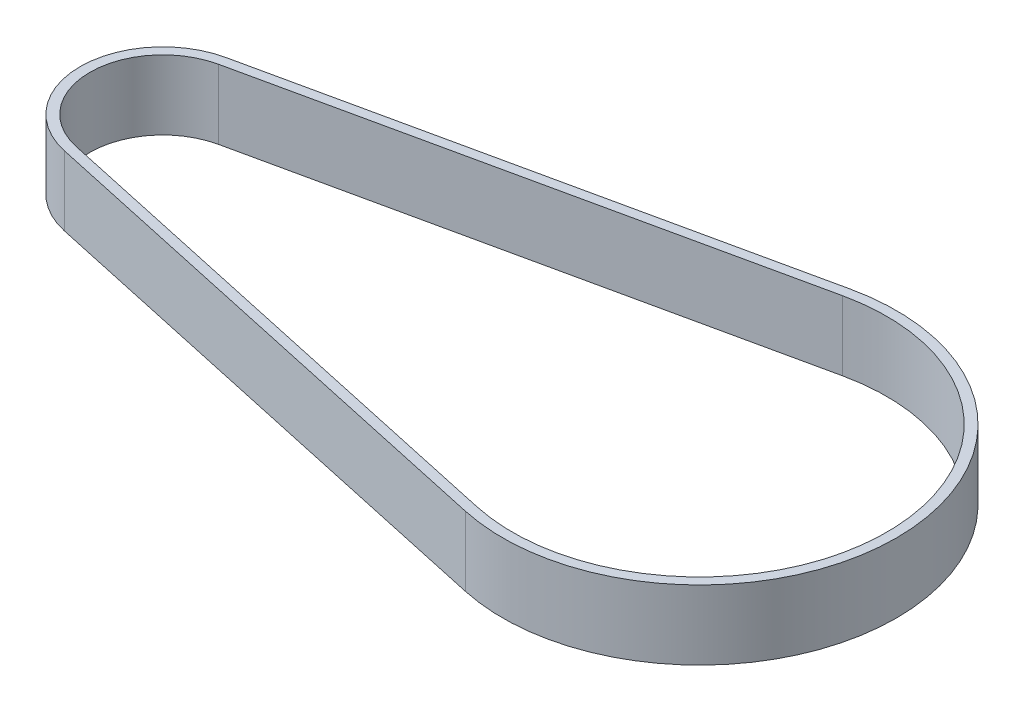
ISO-10303-21;
HEADER;
FILE_DESCRIPTION(('STEP AP214'),'2;1');
FILE_NAME('part.step','',(''),(''),'','','');
FILE_SCHEMA(('AUTOMOTIVE_DESIGN { 1 0 10303 214 1 1 1 1 }'));
ENDSEC;
DATA;
#1=APPLICATION_CONTEXT('core data for automotive mechanical design processes');
#2=APPLICATION_PROTOCOL_DEFINITION('international standard','automotive_design',2000,#1);
#3=PRODUCT_CONTEXT('',#1,'mechanical');
#4=PRODUCT('Part','Part','',(#3));
#5=PRODUCT_RELATED_PRODUCT_CATEGORY('part','',(#4));
#6=PRODUCT_DEFINITION_FORMATION('','',#4);
#7=PRODUCT_DEFINITION_CONTEXT('part definition',#1,'design');
#8=PRODUCT_DEFINITION('design','',#6,#7);
#9=PRODUCT_DEFINITION_SHAPE('','',#8);
#10=(LENGTH_UNIT() NAMED_UNIT(*) SI_UNIT(.MILLI.,.METRE.));
#11=(NAMED_UNIT(*) PLANE_ANGLE_UNIT() SI_UNIT($,.RADIAN.));
#12=(NAMED_UNIT(*) SI_UNIT($,.STERADIAN.) SOLID_ANGLE_UNIT());
#13=UNCERTAINTY_MEASURE_WITH_UNIT(LENGTH_MEASURE(1.E-05),#10,'distance_accuracy_value','');
#14=(GEOMETRIC_REPRESENTATION_CONTEXT(3) GLOBAL_UNCERTAINTY_ASSIGNED_CONTEXT((#13)) GLOBAL_UNIT_ASSIGNED_CONTEXT((#10,
#11,#12)) REPRESENTATION_CONTEXT('',''));
#15=CARTESIAN_POINT('',(0.,0.,0.));
#16=DIRECTION('',(0.,0.,1.));
#17=DIRECTION('',(1.,0.,0.));
#18=AXIS2_PLACEMENT_3D('',#15,#16,#17);
#19=CARTESIAN_POINT('',(-71.8766789781022,9.,10.473355567288));
#20=DIRECTION('',(0.212773722627737,0.,-0.977101500847857));
#21=DIRECTION('',(-0.977101500847857,0.,-0.212773722627737));
#22=AXIS2_PLACEMENT_3D('',#19,#20,#21);
#23=PLANE('',#22);
#24=DIRECTION('',(0.,-1.,0.));
#25=VECTOR('',#24,1.);
#26=CARTESIAN_POINT('',(-5.43147481751825,9.,24.9424700121432));
#27=LINE('',#26,#25);
#28=CARTESIAN_POINT('',(-5.43147481751825,9.,24.9424700121432));
#29=VERTEX_POINT('',#28);
#30=CARTESIAN_POINT('',(-5.43147481751825,0.,24.9424700121432));
#31=VERTEX_POINT('',#30);
#32=EDGE_CURVE('E91',#29,#31,#27,.T.);
#33=ORIENTED_EDGE('',*,*,#32,.F.);
#34=DIRECTION('',(0.977101500847857,0.,0.212773722627737));
#35=VECTOR('',#34,1.);
#36=CARTESIAN_POINT('',(-71.8766789781022,9.,10.473355567288));
#37=LINE('',#36,#35);
#38=CARTESIAN_POINT('',(-71.8766789781022,9.,10.473355567288));
#39=VERTEX_POINT('',#38);
#40=EDGE_CURVE('E90',#39,#29,#37,.T.);
#41=ORIENTED_EDGE('',*,*,#40,.F.);
#42=DIRECTION('',(0.,-1.,0.));
#43=VECTOR('',#42,1.);
#44=CARTESIAN_POINT('',(-71.8766789781022,9.,10.473355567288));
#45=LINE('',#44,#43);
#46=CARTESIAN_POINT('',(-71.8766789781022,0.,10.473355567288));
#47=VERTEX_POINT('',#46);
#48=EDGE_CURVE('E78',#47,#39,#45,.F.);
#49=ORIENTED_EDGE('',*,*,#48,.F.);
#50=DIRECTION('',(0.977101500847857,0.,0.212773722627737));
#51=VECTOR('',#50,1.);
#52=CARTESIAN_POINT('',(-71.8766789781022,0.,10.473355567288));
#53=LINE('',#52,#51);
#54=EDGE_CURVE('E106',#47,#31,#53,.T.);
#55=ORIENTED_EDGE('',*,*,#54,.T.);
#56=EDGE_LOOP('',(#33,#41,#49,#55));
#57=FACE_BOUND('',#56,.T.);
#58=ADVANCED_FACE('F16',(#57),#23,.F.);
#59=CARTESIAN_POINT('',(-69.596,9.,0.));
#60=DIRECTION('',(0.,-1.,0.));
#61=DIRECTION('',(0.,0.,-1.));
#62=AXIS2_PLACEMENT_3D('',#59,#60,#61);
#63=CYLINDRICAL_SURFACE('',#62,10.7188);
#64=CARTESIAN_POINT('',(-69.596,9.,0.));
#65=DIRECTION('',(0.,-1.,0.));
#66=DIRECTION('',(0.,0.,-1.));
#67=AXIS2_PLACEMENT_3D('',#64,#65,#66);
#68=CIRCLE('',#67,10.7188);
#69=CARTESIAN_POINT('',(-71.8766789781022,9.,-10.473355567288));
#70=VERTEX_POINT('',#69);
#71=EDGE_CURVE('E19',#70,#39,#68,.F.);
#72=ORIENTED_EDGE('',*,*,#71,.F.);
#73=DIRECTION('',(0.,1.,0.));
#74=VECTOR('',#73,1.);
#75=CARTESIAN_POINT('',(-71.8766789781022,9.,-10.473355567288));
#76=LINE('',#75,#74);
#77=CARTESIAN_POINT('',(-71.8766789781022,0.,-10.473355567288));
#78=VERTEX_POINT('',#77);
#79=EDGE_CURVE('E98',#70,#78,#76,.F.);
#80=ORIENTED_EDGE('',*,*,#79,.T.);
#81=CARTESIAN_POINT('',(-69.596,0.,0.));
#82=DIRECTION('',(0.,-1.,0.));
#83=DIRECTION('',(0.,0.,-1.));
#84=AXIS2_PLACEMENT_3D('',#81,#82,#83);
#85=CIRCLE('',#84,10.7188);
#86=EDGE_CURVE('E82',#78,#47,#85,.F.);
#87=ORIENTED_EDGE('',*,*,#86,.T.);
#88=ORIENTED_EDGE('',*,*,#48,.T.);
#89=EDGE_LOOP('',(#72,#80,#87,#88));
#90=FACE_BOUND('',#89,.T.);
#91=ADVANCED_FACE('F80',(#90),#63,.T.);
#92=CARTESIAN_POINT('',(-71.606456350365,9.,-9.23243666121123));
#93=DIRECTION('',(0.212773722627737,0.,0.977101500847857));
#94=DIRECTION('',(0.977101500847857,0.,-0.212773722627737));
#95=AXIS2_PLACEMENT_3D('',#92,#93,#94);
#96=PLANE('',#95);
#97=DIRECTION('',(0.977101500847857,0.,-0.212773722627737));
#98=VECTOR('',#97,1.);
#99=CARTESIAN_POINT('',(-71.606456350365,9.,-9.23243666121123));
#100=LINE('',#99,#98);
#101=CARTESIAN_POINT('',(-71.606456350365,9.,-9.23243666121123));
#102=VERTEX_POINT('',#101);
#103=CARTESIAN_POINT('',(-5.16125218978103,9.,-23.7015511060665));
#104=VERTEX_POINT('',#103);
#105=EDGE_CURVE('E121',#102,#104,#100,.T.);
#106=ORIENTED_EDGE('',*,*,#105,.F.);
#107=DIRECTION('',(0.,-1.,0.));
#108=VECTOR('',#107,1.);
#109=CARTESIAN_POINT('',(-71.606456350365,9.,-9.23243666121123));
#110=LINE('',#109,#108);
#111=CARTESIAN_POINT('',(-71.606456350365,0.,-9.23243666121123));
#112=VERTEX_POINT('',#111);
#113=EDGE_CURVE('E99',#102,#112,#110,.T.);
#114=ORIENTED_EDGE('',*,*,#113,.T.);
#115=DIRECTION('',(0.977101500847857,0.,-0.212773722627737));
#116=VECTOR('',#115,1.);
#117=CARTESIAN_POINT('',(-71.606456350365,0.,-9.23243666121123));
#118=LINE('',#117,#116);
#119=CARTESIAN_POINT('',(-5.16125218978103,0.,-23.7015511060665));
#120=VERTEX_POINT('',#119);
#121=EDGE_CURVE('E117',#112,#120,#118,.T.);
#122=ORIENTED_EDGE('',*,*,#121,.T.);
#123=DIRECTION('',(0.,-1.,0.));
#124=VECTOR('',#123,1.);
#125=CARTESIAN_POINT('',(-5.16125218978104,9.,-23.7015511060665));
#126=LINE('',#125,#124);
#127=EDGE_CURVE('E86',#120,#104,#126,.F.);
#128=ORIENTED_EDGE('',*,*,#127,.T.);
#129=EDGE_LOOP('',(#106,#114,#122,#128));
#130=FACE_BOUND('',#129,.T.);
#131=ADVANCED_FACE('F144',(#130),#96,.T.);
#132=CARTESIAN_POINT('',(0.,9.,0.));
#133=DIRECTION('',(0.,-1.,0.));
#134=DIRECTION('',(0.,0.,-1.));
#135=AXIS2_PLACEMENT_3D('',#132,#133,#134);
#136=CYLINDRICAL_SURFACE('',#135,24.257);
#137=CARTESIAN_POINT('',(0.,9.,0.));
#138=DIRECTION('',(0.,-1.,0.));
#139=DIRECTION('',(0.,0.,-1.));
#140=AXIS2_PLACEMENT_3D('',#137,#138,#139);
#141=CIRCLE('',#140,24.257);
#142=CARTESIAN_POINT('',(-5.16125218978103,9.,23.7015511060665));
#143=VERTEX_POINT('',#142);
#144=EDGE_CURVE('E107',#104,#143,#141,.T.);
#145=ORIENTED_EDGE('',*,*,#144,.F.);
#146=ORIENTED_EDGE('',*,*,#127,.F.);
#147=CARTESIAN_POINT('',(0.,0.,0.));
#148=DIRECTION('',(0.,-1.,0.));
#149=DIRECTION('',(0.,0.,-1.));
#150=AXIS2_PLACEMENT_3D('',#147,#148,#149);
#151=CIRCLE('',#150,24.257);
#152=CARTESIAN_POINT('',(-5.16125218978103,0.,23.7015511060665));
#153=VERTEX_POINT('',#152);
#154=EDGE_CURVE('E115',#120,#153,#151,.T.);
#155=ORIENTED_EDGE('',*,*,#154,.T.);
#156=DIRECTION('',(0.,1.,0.));
#157=VECTOR('',#156,1.);
#158=CARTESIAN_POINT('',(-5.16125218978103,9.,23.7015511060665));
#159=LINE('',#158,#157);
#160=EDGE_CURVE('E137',#143,#153,#159,.F.);
#161=ORIENTED_EDGE('',*,*,#160,.F.);
#162=EDGE_LOOP('',(#145,#146,#155,#161));
#163=FACE_BOUND('',#162,.T.);
#164=ADVANCED_FACE('F147',(#163),#136,.F.);
#165=CARTESIAN_POINT('',(-71.606456350365,9.,9.23243666121123));
#166=DIRECTION('',(0.212773722627737,0.,-0.977101500847857));
#167=DIRECTION('',(-0.977101500847857,0.,-0.212773722627737));
#168=AXIS2_PLACEMENT_3D('',#165,#166,#167);
#169=PLANE('',#168);
#170=DIRECTION('',(-0.977101500847857,0.,-0.212773722627737));
#171=VECTOR('',#170,1.);
#172=CARTESIAN_POINT('',(-5.16125218978103,9.,23.7015511060665));
#173=LINE('',#172,#171);
#174=CARTESIAN_POINT('',(-71.606456350365,9.,9.23243666121123));
#175=VERTEX_POINT('',#174);
#176=EDGE_CURVE('E124',#143,#175,#173,.T.);
#177=ORIENTED_EDGE('',*,*,#176,.F.);
#178=ORIENTED_EDGE('',*,*,#160,.T.);
#179=DIRECTION('',(-0.977101500847857,0.,-0.212773722627737));
#180=VECTOR('',#179,1.);
#181=CARTESIAN_POINT('',(-5.16125218978103,0.,23.7015511060665));
#182=LINE('',#181,#180);
#183=CARTESIAN_POINT('',(-71.606456350365,0.,9.23243666121123));
#184=VERTEX_POINT('',#183);
#185=EDGE_CURVE('E114',#153,#184,#182,.T.);
#186=ORIENTED_EDGE('',*,*,#185,.T.);
#187=DIRECTION('',(0.,-1.,0.));
#188=VECTOR('',#187,1.);
#189=CARTESIAN_POINT('',(-71.606456350365,9.,9.23243666121123));
#190=LINE('',#189,#188);
#191=EDGE_CURVE('E102',#184,#175,#190,.F.);
#192=ORIENTED_EDGE('',*,*,#191,.T.);
#193=EDGE_LOOP('',(#177,#178,#186,#192));
#194=FACE_BOUND('',#193,.T.);
#195=ADVANCED_FACE('F150',(#194),#169,.T.);
#196=CARTESIAN_POINT('',(-69.596,9.,0.));
#197=DIRECTION('',(0.,-1.,0.));
#198=DIRECTION('',(0.,0.,-1.));
#199=AXIS2_PLACEMENT_3D('',#196,#197,#198);
#200=CYLINDRICAL_SURFACE('',#199,9.4488);
#201=ORIENTED_EDGE('',*,*,#113,.F.);
#202=CARTESIAN_POINT('',(-69.596,9.,0.));
#203=DIRECTION('',(0.,-1.,0.));
#204=DIRECTION('',(0.,0.,-1.));
#205=AXIS2_PLACEMENT_3D('',#202,#203,#204);
#206=CIRCLE('',#205,9.4488);
#207=EDGE_CURVE('E122',#175,#102,#206,.T.);
#208=ORIENTED_EDGE('',*,*,#207,.F.);
#209=ORIENTED_EDGE('',*,*,#191,.F.);
#210=CARTESIAN_POINT('',(-69.596,0.,0.));
#211=DIRECTION('',(0.,-1.,0.));
#212=DIRECTION('',(0.,0.,-1.));
#213=AXIS2_PLACEMENT_3D('',#210,#211,#212);
#214=CIRCLE('',#213,9.4488);
#215=EDGE_CURVE('E111',#184,#112,#214,.T.);
#216=ORIENTED_EDGE('',*,*,#215,.T.);
#217=EDGE_LOOP('',(#201,#208,#209,#216));
#218=FACE_BOUND('',#217,.T.);
#219=ADVANCED_FACE('F154',(#218),#200,.F.);
#220=CARTESIAN_POINT('',(-71.8766789781022,9.,-10.473355567288));
#221=DIRECTION('',(0.212773722627737,0.,0.977101500847857));
#222=DIRECTION('',(0.977101500847857,0.,-0.212773722627737));
#223=AXIS2_PLACEMENT_3D('',#220,#221,#222);
#224=PLANE('',#223);
#225=ORIENTED_EDGE('',*,*,#79,.F.);
#226=DIRECTION('',(-0.977101500847857,0.,0.212773722627737));
#227=VECTOR('',#226,1.);
#228=CARTESIAN_POINT('',(-5.43147481751823,9.,-24.9424700121433));
#229=LINE('',#228,#227);
#230=CARTESIAN_POINT('',(-5.43147481751824,9.,-24.9424700121432));
#231=VERTEX_POINT('',#230);
#232=EDGE_CURVE('E93',#231,#70,#229,.T.);
#233=ORIENTED_EDGE('',*,*,#232,.F.);
#234=DIRECTION('',(0.,-1.,0.));
#235=VECTOR('',#234,1.);
#236=CARTESIAN_POINT('',(-5.43147481751824,9.,-24.9424700121433));
#237=LINE('',#236,#235);
#238=CARTESIAN_POINT('',(-5.43147481751824,0.,-24.9424700121432));
#239=VERTEX_POINT('',#238);
#240=EDGE_CURVE('E110',#239,#231,#237,.F.);
#241=ORIENTED_EDGE('',*,*,#240,.F.);
#242=DIRECTION('',(-0.977101500847857,0.,0.212773722627737));
#243=VECTOR('',#242,1.);
#244=CARTESIAN_POINT('',(-5.43147481751823,0.,-24.9424700121433));
#245=LINE('',#244,#243);
#246=EDGE_CURVE('E119',#239,#78,#245,.T.);
#247=ORIENTED_EDGE('',*,*,#246,.T.);
#248=EDGE_LOOP('',(#225,#233,#241,#247));
#249=FACE_BOUND('',#248,.T.);
#250=ADVANCED_FACE('F164',(#249),#224,.F.);
#251=CARTESIAN_POINT('',(-69.596,9.,0.));
#252=DIRECTION('',(0.,1.,0.));
#253=DIRECTION('',(0.,0.,1.));
#254=AXIS2_PLACEMENT_3D('',#251,#252,#253);
#255=PLANE('',#254);
#256=ORIENTED_EDGE('',*,*,#105,.T.);
#257=ORIENTED_EDGE('',*,*,#144,.T.);
#258=ORIENTED_EDGE('',*,*,#176,.T.);
#259=ORIENTED_EDGE('',*,*,#207,.T.);
#260=EDGE_LOOP('',(#256,#257,#258,#259));
#261=FACE_BOUND('',#260,.T.);
#262=CARTESIAN_POINT('',(0.,9.,0.));
#263=DIRECTION('',(0.,-1.,0.));
#264=DIRECTION('',(0.,0.,-1.));
#265=AXIS2_PLACEMENT_3D('',#262,#263,#264);
#266=CIRCLE('',#265,25.527);
#267=EDGE_CURVE('E25',#231,#29,#266,.T.);
#268=ORIENTED_EDGE('',*,*,#267,.F.);
#269=ORIENTED_EDGE('',*,*,#232,.T.);
#270=ORIENTED_EDGE('',*,*,#71,.T.);
#271=ORIENTED_EDGE('',*,*,#40,.T.);
#272=EDGE_LOOP('',(#268,#269,#270,#271));
#273=FACE_BOUND('',#272,.T.);
#274=ADVANCED_FACE('F96',(#261,#273),#255,.T.);
#275=CARTESIAN_POINT('',(-69.596,0.,0.));
#276=DIRECTION('',(0.,1.,0.));
#277=DIRECTION('',(0.,0.,1.));
#278=AXIS2_PLACEMENT_3D('',#275,#276,#277);
#279=PLANE('',#278);
#280=ORIENTED_EDGE('',*,*,#185,.F.);
#281=ORIENTED_EDGE('',*,*,#154,.F.);
#282=ORIENTED_EDGE('',*,*,#121,.F.);
#283=ORIENTED_EDGE('',*,*,#215,.F.);
#284=EDGE_LOOP('',(#280,#281,#282,#283));
#285=FACE_BOUND('',#284,.T.);
#286=ORIENTED_EDGE('',*,*,#246,.F.);
#287=CARTESIAN_POINT('',(0.,0.,0.));
#288=DIRECTION('',(0.,-1.,0.));
#289=DIRECTION('',(0.,0.,-1.));
#290=AXIS2_PLACEMENT_3D('',#287,#288,#289);
#291=CIRCLE('',#290,25.527);
#292=EDGE_CURVE('E11',#31,#239,#291,.F.);
#293=ORIENTED_EDGE('',*,*,#292,.F.);
#294=ORIENTED_EDGE('',*,*,#54,.F.);
#295=ORIENTED_EDGE('',*,*,#86,.F.);
#296=EDGE_LOOP('',(#286,#293,#294,#295));
#297=FACE_BOUND('',#296,.T.);
#298=ADVANCED_FACE('F156',(#285,#297),#279,.F.);
#299=CARTESIAN_POINT('',(0.,9.,0.));
#300=DIRECTION('',(0.,-1.,0.));
#301=DIRECTION('',(0.,0.,-1.));
#302=AXIS2_PLACEMENT_3D('',#299,#300,#301);
#303=CYLINDRICAL_SURFACE('',#302,25.527);
#304=ORIENTED_EDGE('',*,*,#292,.T.);
#305=ORIENTED_EDGE('',*,*,#240,.T.);
#306=ORIENTED_EDGE('',*,*,#267,.T.);
#307=ORIENTED_EDGE('',*,*,#32,.T.);
#308=EDGE_LOOP('',(#304,#305,#306,#307));
#309=FACE_BOUND('',#308,.T.);
#310=ADVANCED_FACE('F161',(#309),#303,.T.);
#311=CLOSED_SHELL('',(#58,#91,#131,#164,#195,#219,#250,#274,#298,#310));
#312=MANIFOLD_SOLID_BREP('B1',#311);
#313=ADVANCED_BREP_SHAPE_REPRESENTATION('',(#18,#312),#14);
#314=SHAPE_DEFINITION_REPRESENTATION(#9,#313);
ENDSEC;
END-ISO-10303-21;
